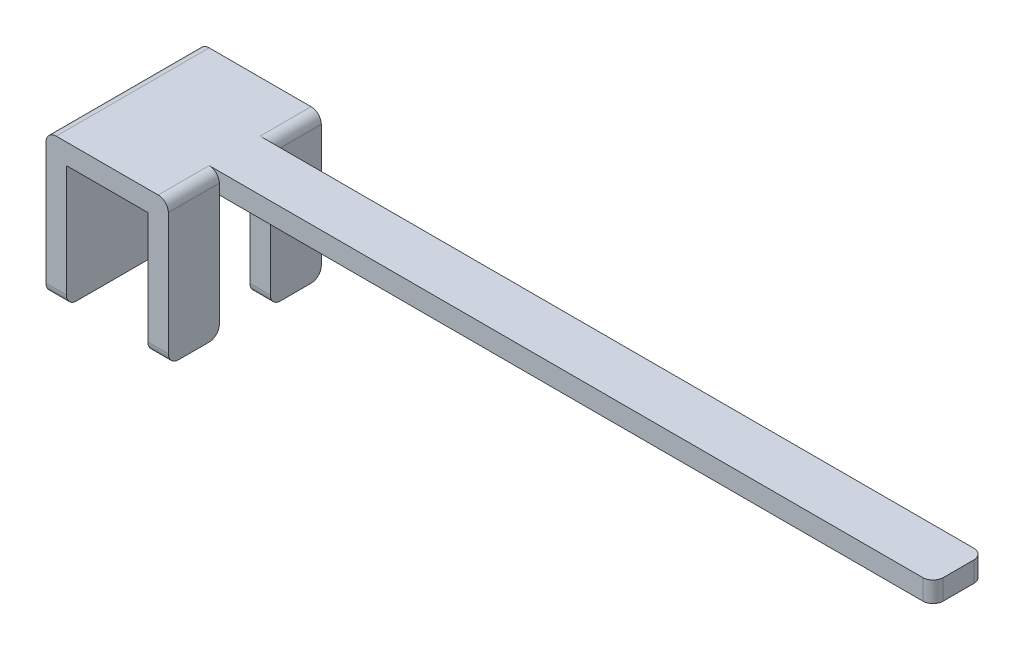
ISO-10303-21;
HEADER;
FILE_DESCRIPTION(('STEP AP214'),'2;1');
FILE_NAME('part.step','',(''),(''),'','','');
FILE_SCHEMA(('AUTOMOTIVE_DESIGN { 1 0 10303 214 1 1 1 1 }'));
ENDSEC;
DATA;
#1=APPLICATION_CONTEXT('core data for automotive mechanical design processes');
#2=APPLICATION_PROTOCOL_DEFINITION('international standard','automotive_design',2000,#1);
#3=PRODUCT_CONTEXT('',#1,'mechanical');
#4=PRODUCT('Part','Part','',(#3));
#5=PRODUCT_RELATED_PRODUCT_CATEGORY('part','',(#4));
#6=PRODUCT_DEFINITION_FORMATION('','',#4);
#7=PRODUCT_DEFINITION_CONTEXT('part definition',#1,'design');
#8=PRODUCT_DEFINITION('design','',#6,#7);
#9=PRODUCT_DEFINITION_SHAPE('','',#8);
#10=(LENGTH_UNIT() NAMED_UNIT(*) SI_UNIT(.MILLI.,.METRE.));
#11=(NAMED_UNIT(*) PLANE_ANGLE_UNIT() SI_UNIT($,.RADIAN.));
#12=(NAMED_UNIT(*) SI_UNIT($,.STERADIAN.) SOLID_ANGLE_UNIT());
#13=UNCERTAINTY_MEASURE_WITH_UNIT(LENGTH_MEASURE(1.E-05),#10,'distance_accuracy_value','');
#14=(GEOMETRIC_REPRESENTATION_CONTEXT(3) GLOBAL_UNCERTAINTY_ASSIGNED_CONTEXT((#13)) GLOBAL_UNIT_ASSIGNED_CONTEXT((#10,
#11,#12)) REPRESENTATION_CONTEXT('',''));
#15=CARTESIAN_POINT('',(0.,0.,0.));
#16=DIRECTION('',(0.,0.,1.));
#17=DIRECTION('',(1.,0.,0.));
#18=AXIS2_PLACEMENT_3D('',#15,#16,#17);
#19=CARTESIAN_POINT('',(0.4,0.6,1.5));
#20=DIRECTION('',(1.,0.,0.));
#21=DIRECTION('',(0.,1.,0.));
#22=AXIS2_PLACEMENT_3D('',#19,#20,#21);
#23=PLANE('',#22);
#24=DIRECTION('',(0.,-1.,0.));
#25=VECTOR('',#24,1.);
#26=CARTESIAN_POINT('',(0.4,0.6,1.));
#27=LINE('',#26,#25);
#28=CARTESIAN_POINT('',(0.4,0.6,1.));
#29=VERTEX_POINT('',#28);
#30=CARTESIAN_POINT('',(0.4,-0.5,1.));
#31=VERTEX_POINT('',#30);
#32=EDGE_CURVE('E213',#29,#31,#27,.T.);
#33=ORIENTED_EDGE('',*,*,#32,.T.);
#34=CARTESIAN_POINT('',(0.4,-0.5,1.1));
#35=DIRECTION('',(1.,0.,0.));
#36=DIRECTION('',(0.,1.,0.));
#37=AXIS2_PLACEMENT_3D('',#34,#35,#36);
#38=CIRCLE('',#37,0.1);
#39=CARTESIAN_POINT('',(0.4,-0.6,1.1));
#40=VERTEX_POINT('',#39);
#41=EDGE_CURVE('E397',#31,#40,#38,.F.);
#42=ORIENTED_EDGE('',*,*,#41,.T.);
#43=DIRECTION('',(0.,0.,-1.));
#44=VECTOR('',#43,1.);
#45=CARTESIAN_POINT('',(0.4,-0.6,1.5));
#46=LINE('',#45,#44);
#47=CARTESIAN_POINT('',(0.4,-0.6,1.4));
#48=VERTEX_POINT('',#47);
#49=EDGE_CURVE('E335',#48,#40,#46,.T.);
#50=ORIENTED_EDGE('',*,*,#49,.F.);
#51=CARTESIAN_POINT('',(0.4,-0.5,1.4));
#52=DIRECTION('',(1.,0.,0.));
#53=DIRECTION('',(0.,1.,0.));
#54=AXIS2_PLACEMENT_3D('',#51,#52,#53);
#55=CIRCLE('',#54,0.1);
#56=CARTESIAN_POINT('',(0.4,-0.5,1.5));
#57=VERTEX_POINT('',#56);
#58=EDGE_CURVE('E50',#48,#57,#55,.F.);
#59=ORIENTED_EDGE('',*,*,#58,.T.);
#60=DIRECTION('',(0.,-1.,0.));
#61=VECTOR('',#60,1.);
#62=CARTESIAN_POINT('',(0.4,0.6,1.5));
#63=LINE('',#62,#61);
#64=CARTESIAN_POINT('',(0.4,0.6,1.5));
#65=VERTEX_POINT('',#64);
#66=EDGE_CURVE('E270',#65,#57,#63,.T.);
#67=ORIENTED_EDGE('',*,*,#66,.F.);
#68=DIRECTION('',(0.,0.,-1.));
#69=VECTOR('',#68,1.);
#70=CARTESIAN_POINT('',(0.4,0.6,1.5));
#71=LINE('',#70,#69);
#72=EDGE_CURVE('E307',#65,#29,#71,.T.);
#73=ORIENTED_EDGE('',*,*,#72,.T.);
#74=EDGE_LOOP('',(#33,#42,#50,#59,#67,#73));
#75=FACE_BOUND('',#74,.T.);
#76=ADVANCED_FACE('F35',(#75),#23,.F.);
#77=CARTESIAN_POINT('',(0.4,-0.6,1.5));
#78=DIRECTION('',(0.,1.,0.));
#79=DIRECTION('',(-1.,0.,0.));
#80=AXIS2_PLACEMENT_3D('',#77,#78,#79);
#81=PLANE('',#80);
#82=ORIENTED_EDGE('',*,*,#49,.T.);
#83=DIRECTION('',(1.,0.,0.));
#84=VECTOR('',#83,1.);
#85=CARTESIAN_POINT('',(0.4,-0.6,1.1));
#86=LINE('',#85,#84);
#87=CARTESIAN_POINT('',(0.6,-0.6,1.1));
#88=VERTEX_POINT('',#87);
#89=EDGE_CURVE('E389',#40,#88,#86,.T.);
#90=ORIENTED_EDGE('',*,*,#89,.T.);
#91=DIRECTION('',(0.,0.,-1.));
#92=VECTOR('',#91,1.);
#93=CARTESIAN_POINT('',(0.6,-0.6,1.5));
#94=LINE('',#93,#92);
#95=CARTESIAN_POINT('',(0.6,-0.6,1.4));
#96=VERTEX_POINT('',#95);
#97=EDGE_CURVE('E332',#96,#88,#94,.T.);
#98=ORIENTED_EDGE('',*,*,#97,.F.);
#99=DIRECTION('',(1.,0.,0.));
#100=VECTOR('',#99,1.);
#101=CARTESIAN_POINT('',(0.4,-0.6,1.4));
#102=LINE('',#101,#100);
#103=EDGE_CURVE('E387',#96,#48,#102,.F.);
#104=ORIENTED_EDGE('',*,*,#103,.T.);
#105=EDGE_LOOP('',(#82,#90,#98,#104));
#106=FACE_BOUND('',#105,.T.);
#107=ADVANCED_FACE('F420',(#106),#81,.F.);
#108=CARTESIAN_POINT('',(0.6,0.699999999999999,1.5));
#109=DIRECTION('',(-1.,0.,0.));
#110=DIRECTION('',(0.,0.,1.));
#111=AXIS2_PLACEMENT_3D('',#108,#109,#110);
#112=PLANE('',#111);
#113=ORIENTED_EDGE('',*,*,#97,.T.);
#114=CARTESIAN_POINT('',(0.6,-0.499999999999999,1.1));
#115=DIRECTION('',(-1.,0.,0.));
#116=DIRECTION('',(0.,0.,1.));
#117=AXIS2_PLACEMENT_3D('',#114,#115,#116);
#118=CIRCLE('',#117,0.1);
#119=CARTESIAN_POINT('',(0.6,-0.499999999999999,1.));
#120=VERTEX_POINT('',#119);
#121=EDGE_CURVE('E228',#88,#120,#118,.F.);
#122=ORIENTED_EDGE('',*,*,#121,.T.);
#123=DIRECTION('',(0.,-1.,0.));
#124=VECTOR('',#123,1.);
#125=CARTESIAN_POINT('',(0.6,0.6,1.));
#126=LINE('',#125,#124);
#127=CARTESIAN_POINT('',(0.6,0.6,1.));
#128=VERTEX_POINT('',#127);
#129=EDGE_CURVE('E212',#128,#120,#126,.T.);
#130=ORIENTED_EDGE('',*,*,#129,.F.);
#131=DIRECTION('',(0.,1.,0.));
#132=VECTOR('',#131,1.);
#133=CARTESIAN_POINT('',(0.6,0.699999999999999,1.));
#134=LINE('',#133,#132);
#135=CARTESIAN_POINT('',(0.6,0.699999999999999,1.));
#136=VERTEX_POINT('',#135);
#137=EDGE_CURVE('E226',#128,#136,#134,.T.);
#138=ORIENTED_EDGE('',*,*,#137,.T.);
#139=DIRECTION('',(0.,0.,-1.));
#140=VECTOR('',#139,1.);
#141=CARTESIAN_POINT('',(0.6,0.699999999999999,1.5));
#142=LINE('',#141,#140);
#143=CARTESIAN_POINT('',(0.6,0.699999999999999,1.5));
#144=VERTEX_POINT('',#143);
#145=EDGE_CURVE('E329',#144,#136,#142,.T.);
#146=ORIENTED_EDGE('',*,*,#145,.F.);
#147=DIRECTION('',(0.,1.,0.));
#148=VECTOR('',#147,1.);
#149=CARTESIAN_POINT('',(0.6,0.699999999999999,1.5));
#150=LINE('',#149,#148);
#151=CARTESIAN_POINT('',(0.6,-0.499999999999999,1.5));
#152=VERTEX_POINT('',#151);
#153=EDGE_CURVE('E272',#152,#144,#150,.T.);
#154=ORIENTED_EDGE('',*,*,#153,.F.);
#155=CARTESIAN_POINT('',(0.6,-0.499999999999999,1.4));
#156=DIRECTION('',(-1.,0.,0.));
#157=DIRECTION('',(0.,0.,1.));
#158=AXIS2_PLACEMENT_3D('',#155,#156,#157);
#159=CIRCLE('',#158,0.1);
#160=EDGE_CURVE('E392',#152,#96,#159,.F.);
#161=ORIENTED_EDGE('',*,*,#160,.T.);
#162=EDGE_LOOP('',(#113,#122,#130,#138,#146,#154,#161));
#163=FACE_BOUND('',#162,.T.);
#164=ADVANCED_FACE('F224',(#163),#112,.F.);
#165=CARTESIAN_POINT('',(0.5,0.699999999999999,1.5));
#166=DIRECTION('',(0.,0.,-1.));
#167=DIRECTION('',(-1.,0.,0.));
#168=AXIS2_PLACEMENT_3D('',#165,#166,#167);
#169=CYLINDRICAL_SURFACE('',#168,0.1);
#170=CARTESIAN_POINT('',(0.5,0.699999999999999,0.5));
#171=DIRECTION('',(0.,0.,1.));
#172=DIRECTION('',(1.,0.,0.));
#173=AXIS2_PLACEMENT_3D('',#170,#171,#172);
#174=CIRCLE('',#173,0.1);
#175=CARTESIAN_POINT('',(0.6,0.699999999999999,0.5));
#176=VERTEX_POINT('',#175);
#177=CARTESIAN_POINT('',(0.5,0.8,0.5));
#178=VERTEX_POINT('',#177);
#179=EDGE_CURVE('E263',#176,#178,#174,.T.);
#180=ORIENTED_EDGE('',*,*,#179,.F.);
#181=CARTESIAN_POINT('',(0.6,0.699999999999999,0.));
#182=VERTEX_POINT('',#181);
#183=EDGE_CURVE('E328',#176,#182,#142,.T.);
#184=ORIENTED_EDGE('',*,*,#183,.T.);
#185=CARTESIAN_POINT('',(0.5,0.699999999999999,0.));
#186=DIRECTION('',(0.,0.,1.));
#187=DIRECTION('',(1.,0.,0.));
#188=AXIS2_PLACEMENT_3D('',#185,#186,#187);
#189=CIRCLE('',#188,0.1);
#190=CARTESIAN_POINT('',(0.5,0.8,0.));
#191=VERTEX_POINT('',#190);
#192=EDGE_CURVE('E293',#182,#191,#189,.T.);
#193=ORIENTED_EDGE('',*,*,#192,.T.);
#194=DIRECTION('',(0.,0.,-1.));
#195=VECTOR('',#194,1.);
#196=CARTESIAN_POINT('',(0.5,0.8,1.5));
#197=LINE('',#196,#195);
#198=EDGE_CURVE('E324',#178,#191,#197,.T.);
#199=ORIENTED_EDGE('',*,*,#198,.F.);
#200=EDGE_LOOP('',(#180,#184,#193,#199));
#201=FACE_BOUND('',#200,.T.);
#202=ADVANCED_FACE('F492',(#201),#169,.T.);
#203=DIRECTION('',(0.,-1.,0.));
#204=VECTOR('',#203,1.);
#205=CARTESIAN_POINT('',(0.4,0.6,0.));
#206=LINE('',#205,#204);
#207=CARTESIAN_POINT('',(0.4,0.6,0.));
#208=VERTEX_POINT('',#207);
#209=CARTESIAN_POINT('',(0.4,-0.5,0.));
#210=VERTEX_POINT('',#209);
#211=EDGE_CURVE('E240',#208,#210,#206,.T.);
#212=ORIENTED_EDGE('',*,*,#211,.T.);
#213=CARTESIAN_POINT('',(0.4,-0.5,0.1));
#214=DIRECTION('',(1.,0.,0.));
#215=DIRECTION('',(0.,1.,0.));
#216=AXIS2_PLACEMENT_3D('',#213,#214,#215);
#217=CIRCLE('',#216,0.1);
#218=CARTESIAN_POINT('',(0.4,-0.6,0.1));
#219=VERTEX_POINT('',#218);
#220=EDGE_CURVE('E382',#210,#219,#217,.F.);
#221=ORIENTED_EDGE('',*,*,#220,.T.);
#222=CARTESIAN_POINT('',(0.4,-0.6,0.4));
#223=VERTEX_POINT('',#222);
#224=EDGE_CURVE('E334',#223,#219,#46,.T.);
#225=ORIENTED_EDGE('',*,*,#224,.F.);
#226=CARTESIAN_POINT('',(0.4,-0.5,0.4));
#227=DIRECTION('',(1.,0.,0.));
#228=DIRECTION('',(0.,1.,0.));
#229=AXIS2_PLACEMENT_3D('',#226,#227,#228);
#230=CIRCLE('',#229,0.1);
#231=CARTESIAN_POINT('',(0.4,-0.5,0.5));
#232=VERTEX_POINT('',#231);
#233=EDGE_CURVE('E380',#223,#232,#230,.F.);
#234=ORIENTED_EDGE('',*,*,#233,.T.);
#235=DIRECTION('',(0.,1.,0.));
#236=VECTOR('',#235,1.);
#237=CARTESIAN_POINT('',(0.4,0.6,0.5));
#238=LINE('',#237,#236);
#239=CARTESIAN_POINT('',(0.4,0.6,0.5));
#240=VERTEX_POINT('',#239);
#241=EDGE_CURVE('E218',#232,#240,#238,.T.);
#242=ORIENTED_EDGE('',*,*,#241,.T.);
#243=EDGE_CURVE('E288',#240,#208,#71,.T.);
#244=ORIENTED_EDGE('',*,*,#243,.T.);
#245=EDGE_LOOP('',(#212,#221,#225,#234,#242,#244));
#246=FACE_BOUND('',#245,.T.);
#247=ADVANCED_FACE('F494',(#246),#23,.F.);
#248=ORIENTED_EDGE('',*,*,#224,.T.);
#249=DIRECTION('',(1.,0.,0.));
#250=VECTOR('',#249,1.);
#251=CARTESIAN_POINT('',(0.4,-0.6,0.1));
#252=LINE('',#251,#250);
#253=CARTESIAN_POINT('',(0.6,-0.6,0.1));
#254=VERTEX_POINT('',#253);
#255=EDGE_CURVE('E373',#219,#254,#252,.T.);
#256=ORIENTED_EDGE('',*,*,#255,.T.);
#257=CARTESIAN_POINT('',(0.6,-0.6,0.4));
#258=VERTEX_POINT('',#257);
#259=EDGE_CURVE('E331',#258,#254,#94,.T.);
#260=ORIENTED_EDGE('',*,*,#259,.F.);
#261=DIRECTION('',(1.,0.,0.));
#262=VECTOR('',#261,1.);
#263=CARTESIAN_POINT('',(0.4,-0.6,0.4));
#264=LINE('',#263,#262);
#265=EDGE_CURVE('E371',#258,#223,#264,.F.);
#266=ORIENTED_EDGE('',*,*,#265,.T.);
#267=EDGE_LOOP('',(#248,#256,#260,#266));
#268=FACE_BOUND('',#267,.T.);
#269=ADVANCED_FACE('F500',(#268),#81,.F.);
#270=ORIENTED_EDGE('',*,*,#259,.T.);
#271=CARTESIAN_POINT('',(0.6,-0.499999999999999,0.1));
#272=DIRECTION('',(-1.,0.,0.));
#273=DIRECTION('',(0.,0.,1.));
#274=AXIS2_PLACEMENT_3D('',#271,#272,#273);
#275=CIRCLE('',#274,0.1);
#276=CARTESIAN_POINT('',(0.6,-0.499999999999999,0.));
#277=VERTEX_POINT('',#276);
#278=EDGE_CURVE('E378',#254,#277,#275,.F.);
#279=ORIENTED_EDGE('',*,*,#278,.T.);
#280=DIRECTION('',(0.,1.,0.));
#281=VECTOR('',#280,1.);
#282=CARTESIAN_POINT('',(0.6,0.699999999999999,0.));
#283=LINE('',#282,#281);
#284=EDGE_CURVE('E291',#277,#182,#283,.T.);
#285=ORIENTED_EDGE('',*,*,#284,.T.);
#286=ORIENTED_EDGE('',*,*,#183,.F.);
#287=DIRECTION('',(0.,1.,0.));
#288=VECTOR('',#287,1.);
#289=CARTESIAN_POINT('',(0.6,0.699999999999999,0.5));
#290=LINE('',#289,#288);
#291=CARTESIAN_POINT('',(0.6,0.6,0.5));
#292=VERTEX_POINT('',#291);
#293=EDGE_CURVE('E266',#292,#176,#290,.T.);
#294=ORIENTED_EDGE('',*,*,#293,.F.);
#295=DIRECTION('',(0.,1.,0.));
#296=VECTOR('',#295,1.);
#297=CARTESIAN_POINT('',(0.6,0.6,0.5));
#298=LINE('',#297,#296);
#299=CARTESIAN_POINT('',(0.6,-0.499999999999999,0.5));
#300=VERTEX_POINT('',#299);
#301=EDGE_CURVE('E229',#300,#292,#298,.T.);
#302=ORIENTED_EDGE('',*,*,#301,.F.);
#303=CARTESIAN_POINT('',(0.6,-0.499999999999999,0.4));
#304=DIRECTION('',(-1.,0.,0.));
#305=DIRECTION('',(0.,0.,1.));
#306=AXIS2_PLACEMENT_3D('',#303,#304,#305);
#307=CIRCLE('',#306,0.1);
#308=EDGE_CURVE('E376',#300,#258,#307,.F.);
#309=ORIENTED_EDGE('',*,*,#308,.T.);
#310=EDGE_LOOP('',(#270,#279,#285,#286,#294,#302,#309));
#311=FACE_BOUND('',#310,.T.);
#312=ADVANCED_FACE('F442',(#311),#112,.F.);
#313=ORIENTED_EDGE('',*,*,#145,.T.);
#314=CARTESIAN_POINT('',(0.5,0.699999999999999,1.));
#315=DIRECTION('',(0.,0.,1.));
#316=DIRECTION('',(1.,0.,0.));
#317=AXIS2_PLACEMENT_3D('',#314,#315,#316);
#318=CIRCLE('',#317,0.1);
#319=CARTESIAN_POINT('',(0.5,0.8,1.));
#320=VERTEX_POINT('',#319);
#321=EDGE_CURVE('E239',#136,#320,#318,.T.);
#322=ORIENTED_EDGE('',*,*,#321,.T.);
#323=CARTESIAN_POINT('',(0.5,0.8,1.5));
#324=VERTEX_POINT('',#323);
#325=EDGE_CURVE('E325',#324,#320,#197,.T.);
#326=ORIENTED_EDGE('',*,*,#325,.F.);
#327=CARTESIAN_POINT('',(0.5,0.699999999999999,1.5));
#328=DIRECTION('',(0.,0.,1.));
#329=DIRECTION('',(1.,0.,0.));
#330=AXIS2_PLACEMENT_3D('',#327,#328,#329);
#331=CIRCLE('',#330,0.1);
#332=EDGE_CURVE('E275',#144,#324,#331,.T.);
#333=ORIENTED_EDGE('',*,*,#332,.F.);
#334=EDGE_LOOP('',(#313,#322,#326,#333));
#335=FACE_BOUND('',#334,.T.);
#336=ADVANCED_FACE('F465',(#335),#169,.T.);
#337=CARTESIAN_POINT('',(-0.5,0.8,1.5));
#338=DIRECTION('',(0.,-1.,0.));
#339=DIRECTION('',(1.,0.,0.));
#340=AXIS2_PLACEMENT_3D('',#337,#338,#339);
#341=PLANE('',#340);
#342=DIRECTION('',(-1.,0.,0.));
#343=VECTOR('',#342,1.);
#344=CARTESIAN_POINT('',(0.,0.8,1.));
#345=LINE('',#344,#343);
#346=CARTESIAN_POINT('',(7.5,0.8,1.));
#347=VERTEX_POINT('',#346);
#348=EDGE_CURVE('E246',#347,#320,#345,.T.);
#349=ORIENTED_EDGE('',*,*,#348,.F.);
#350=CARTESIAN_POINT('',(7.5,0.800000000000002,0.9));
#351=DIRECTION('',(0.,-1.,0.));
#352=DIRECTION('',(1.,0.,0.));
#353=AXIS2_PLACEMENT_3D('',#350,#351,#352);
#354=CIRCLE('',#353,0.1);
#355=CARTESIAN_POINT('',(7.6,0.8,0.9));
#356=VERTEX_POINT('',#355);
#357=EDGE_CURVE('E342',#347,#356,#354,.F.);
#358=ORIENTED_EDGE('',*,*,#357,.T.);
#359=DIRECTION('',(0.,0.,-1.));
#360=VECTOR('',#359,1.);
#361=CARTESIAN_POINT('',(7.6,0.8,1.));
#362=LINE('',#361,#360);
#363=CARTESIAN_POINT('',(7.6,0.8,0.6));
#364=VERTEX_POINT('',#363);
#365=EDGE_CURVE('E249',#356,#364,#362,.T.);
#366=ORIENTED_EDGE('',*,*,#365,.T.);
#367=CARTESIAN_POINT('',(7.5,0.800000000000002,0.6));
#368=DIRECTION('',(0.,-1.,0.));
#369=DIRECTION('',(1.,0.,0.));
#370=AXIS2_PLACEMENT_3D('',#367,#368,#369);
#371=CIRCLE('',#370,0.1);
#372=CARTESIAN_POINT('',(7.5,0.8,0.5));
#373=VERTEX_POINT('',#372);
#374=EDGE_CURVE('E340',#364,#373,#371,.F.);
#375=ORIENTED_EDGE('',*,*,#374,.T.);
#376=DIRECTION('',(-1.,0.,0.));
#377=VECTOR('',#376,1.);
#378=CARTESIAN_POINT('',(0.,0.8,0.5));
#379=LINE('',#378,#377);
#380=EDGE_CURVE('E247',#373,#178,#379,.T.);
#381=ORIENTED_EDGE('',*,*,#380,.T.);
#382=ORIENTED_EDGE('',*,*,#198,.T.);
#383=DIRECTION('',(-1.,0.,0.));
#384=VECTOR('',#383,1.);
#385=CARTESIAN_POINT('',(-0.5,0.8,0.));
#386=LINE('',#385,#384);
#387=CARTESIAN_POINT('',(-0.5,0.8,0.));
#388=VERTEX_POINT('',#387);
#389=EDGE_CURVE('E296',#191,#388,#386,.T.);
#390=ORIENTED_EDGE('',*,*,#389,.T.);
#391=DIRECTION('',(0.,0.,-1.));
#392=VECTOR('',#391,1.);
#393=CARTESIAN_POINT('',(-0.5,0.8,1.5));
#394=LINE('',#393,#392);
#395=CARTESIAN_POINT('',(-0.5,0.8,1.5));
#396=VERTEX_POINT('',#395);
#397=EDGE_CURVE('E321',#396,#388,#394,.T.);
#398=ORIENTED_EDGE('',*,*,#397,.F.);
#399=DIRECTION('',(-1.,0.,0.));
#400=VECTOR('',#399,1.);
#401=CARTESIAN_POINT('',(-0.5,0.8,1.5));
#402=LINE('',#401,#400);
#403=EDGE_CURVE('E277',#324,#396,#402,.T.);
#404=ORIENTED_EDGE('',*,*,#403,.F.);
#405=ORIENTED_EDGE('',*,*,#325,.T.);
#406=EDGE_LOOP('',(#349,#358,#366,#375,#381,#382,#390,#398,#404,#405));
#407=FACE_BOUND('',#406,.T.);
#408=ADVANCED_FACE('F459',(#407),#341,.F.);
#409=CARTESIAN_POINT('',(-0.5,0.7,1.5));
#410=DIRECTION('',(0.,0.,-1.));
#411=DIRECTION('',(-1.,0.,0.));
#412=AXIS2_PLACEMENT_3D('',#409,#410,#411);
#413=CYLINDRICAL_SURFACE('',#412,0.1);
#414=CARTESIAN_POINT('',(-0.5,0.7,0.));
#415=DIRECTION('',(0.,0.,1.));
#416=DIRECTION('',(-1.,0.,0.));
#417=AXIS2_PLACEMENT_3D('',#414,#415,#416);
#418=CIRCLE('',#417,0.1);
#419=CARTESIAN_POINT('',(-0.6,0.7,0.));
#420=VERTEX_POINT('',#419);
#421=EDGE_CURVE('E298',#388,#420,#418,.T.);
#422=ORIENTED_EDGE('',*,*,#421,.T.);
#423=DIRECTION('',(0.,0.,-1.));
#424=VECTOR('',#423,1.);
#425=CARTESIAN_POINT('',(-0.6,0.7,1.5));
#426=LINE('',#425,#424);
#427=CARTESIAN_POINT('',(-0.6,0.7,1.5));
#428=VERTEX_POINT('',#427);
#429=EDGE_CURVE('E318',#428,#420,#426,.T.);
#430=ORIENTED_EDGE('',*,*,#429,.F.);
#431=CARTESIAN_POINT('',(-0.5,0.7,1.5));
#432=DIRECTION('',(0.,0.,1.));
#433=DIRECTION('',(-1.,0.,0.));
#434=AXIS2_PLACEMENT_3D('',#431,#432,#433);
#435=CIRCLE('',#434,0.1);
#436=EDGE_CURVE('E279',#396,#428,#435,.T.);
#437=ORIENTED_EDGE('',*,*,#436,.F.);
#438=ORIENTED_EDGE('',*,*,#397,.T.);
#439=EDGE_LOOP('',(#422,#430,#437,#438));
#440=FACE_BOUND('',#439,.T.);
#441=ADVANCED_FACE('F471',(#440),#413,.T.);
#442=CARTESIAN_POINT('',(-0.6,0.7,1.5));
#443=DIRECTION('',(1.,0.,0.));
#444=DIRECTION('',(0.,0.,-1.));
#445=AXIS2_PLACEMENT_3D('',#442,#443,#444);
#446=PLANE('',#445);
#447=DIRECTION('',(0.,-1.,0.));
#448=VECTOR('',#447,1.);
#449=CARTESIAN_POINT('',(-0.6,0.7,0.));
#450=LINE('',#449,#448);
#451=CARTESIAN_POINT('',(-0.6,-0.5,0.));
#452=VERTEX_POINT('',#451);
#453=EDGE_CURVE('E300',#420,#452,#450,.T.);
#454=ORIENTED_EDGE('',*,*,#453,.T.);
#455=CARTESIAN_POINT('',(-0.6,-0.5,0.1));
#456=DIRECTION('',(1.,0.,0.));
#457=DIRECTION('',(0.,0.,-1.));
#458=AXIS2_PLACEMENT_3D('',#455,#456,#457);
#459=CIRCLE('',#458,0.1);
#460=CARTESIAN_POINT('',(-0.6,-0.6,0.1));
#461=VERTEX_POINT('',#460);
#462=EDGE_CURVE('E369',#452,#461,#459,.F.);
#463=ORIENTED_EDGE('',*,*,#462,.T.);
#464=DIRECTION('',(0.,0.,-1.));
#465=VECTOR('',#464,1.);
#466=CARTESIAN_POINT('',(-0.6,-0.6,1.5));
#467=LINE('',#466,#465);
#468=CARTESIAN_POINT('',(-0.6,-0.6,1.4));
#469=VERTEX_POINT('',#468);
#470=EDGE_CURVE('E315',#469,#461,#467,.T.);
#471=ORIENTED_EDGE('',*,*,#470,.F.);
#472=CARTESIAN_POINT('',(-0.6,-0.5,1.4));
#473=DIRECTION('',(1.,0.,0.));
#474=DIRECTION('',(0.,0.,-1.));
#475=AXIS2_PLACEMENT_3D('',#472,#473,#474);
#476=CIRCLE('',#475,0.1);
#477=CARTESIAN_POINT('',(-0.6,-0.5,1.5));
#478=VERTEX_POINT('',#477);
#479=EDGE_CURVE('E367',#469,#478,#476,.F.);
#480=ORIENTED_EDGE('',*,*,#479,.T.);
#481=DIRECTION('',(0.,-1.,0.));
#482=VECTOR('',#481,1.);
#483=CARTESIAN_POINT('',(-0.6,0.7,1.5));
#484=LINE('',#483,#482);
#485=EDGE_CURVE('E281',#428,#478,#484,.T.);
#486=ORIENTED_EDGE('',*,*,#485,.F.);
#487=ORIENTED_EDGE('',*,*,#429,.T.);
#488=EDGE_LOOP('',(#454,#463,#471,#480,#486,#487));
#489=FACE_BOUND('',#488,.T.);
#490=ADVANCED_FACE('F474',(#489),#446,.F.);
#491=CARTESIAN_POINT('',(-0.4,-0.6,1.5));
#492=DIRECTION('',(0.,1.,0.));
#493=DIRECTION('',(0.,0.,1.));
#494=AXIS2_PLACEMENT_3D('',#491,#492,#493);
#495=PLANE('',#494);
#496=ORIENTED_EDGE('',*,*,#470,.T.);
#497=DIRECTION('',(1.,0.,0.));
#498=VECTOR('',#497,1.);
#499=CARTESIAN_POINT('',(-0.4,-0.6,0.1));
#500=LINE('',#499,#498);
#501=CARTESIAN_POINT('',(-0.4,-0.6,0.1));
#502=VERTEX_POINT('',#501);
#503=EDGE_CURVE('E356',#461,#502,#500,.T.);
#504=ORIENTED_EDGE('',*,*,#503,.T.);
#505=DIRECTION('',(0.,0.,-1.));
#506=VECTOR('',#505,1.);
#507=CARTESIAN_POINT('',(-0.4,-0.6,1.5));
#508=LINE('',#507,#506);
#509=CARTESIAN_POINT('',(-0.4,-0.6,1.4));
#510=VERTEX_POINT('',#509);
#511=EDGE_CURVE('E312',#510,#502,#508,.T.);
#512=ORIENTED_EDGE('',*,*,#511,.F.);
#513=DIRECTION('',(1.,0.,0.));
#514=VECTOR('',#513,1.);
#515=CARTESIAN_POINT('',(-0.6,-0.6,1.4));
#516=LINE('',#515,#514);
#517=EDGE_CURVE('E354',#510,#469,#516,.F.);
#518=ORIENTED_EDGE('',*,*,#517,.T.);
#519=EDGE_LOOP('',(#496,#504,#512,#518));
#520=FACE_BOUND('',#519,.T.);
#521=ADVANCED_FACE('F478',(#520),#495,.F.);
#522=CARTESIAN_POINT('',(-0.4,0.6,1.5));
#523=DIRECTION('',(-1.,0.,0.));
#524=DIRECTION('',(0.,-1.,0.));
#525=AXIS2_PLACEMENT_3D('',#522,#523,#524);
#526=PLANE('',#525);
#527=ORIENTED_EDGE('',*,*,#511,.T.);
#528=CARTESIAN_POINT('',(-0.4,-0.5,0.1));
#529=DIRECTION('',(-1.,0.,0.));
#530=DIRECTION('',(0.,-1.,0.));
#531=AXIS2_PLACEMENT_3D('',#528,#529,#530);
#532=CIRCLE('',#531,0.1);
#533=CARTESIAN_POINT('',(-0.4,-0.5,0.));
#534=VERTEX_POINT('',#533);
#535=EDGE_CURVE('E361',#502,#534,#532,.F.);
#536=ORIENTED_EDGE('',*,*,#535,.T.);
#537=DIRECTION('',(0.,1.,0.));
#538=VECTOR('',#537,1.);
#539=CARTESIAN_POINT('',(-0.4,0.6,0.));
#540=LINE('',#539,#538);
#541=CARTESIAN_POINT('',(-0.4,0.6,0.));
#542=VERTEX_POINT('',#541);
#543=EDGE_CURVE('E303',#534,#542,#540,.T.);
#544=ORIENTED_EDGE('',*,*,#543,.T.);
#545=DIRECTION('',(0.,0.,-1.));
#546=VECTOR('',#545,1.);
#547=CARTESIAN_POINT('',(-0.4,0.6,1.5));
#548=LINE('',#547,#546);
#549=CARTESIAN_POINT('',(-0.4,0.6,1.5));
#550=VERTEX_POINT('',#549);
#551=EDGE_CURVE('E309',#550,#542,#548,.T.);
#552=ORIENTED_EDGE('',*,*,#551,.F.);
#553=DIRECTION('',(0.,1.,0.));
#554=VECTOR('',#553,1.);
#555=CARTESIAN_POINT('',(-0.4,0.6,1.5));
#556=LINE('',#555,#554);
#557=CARTESIAN_POINT('',(-0.4,-0.5,1.5));
#558=VERTEX_POINT('',#557);
#559=EDGE_CURVE('E284',#558,#550,#556,.T.);
#560=ORIENTED_EDGE('',*,*,#559,.F.);
#561=CARTESIAN_POINT('',(-0.4,-0.5,1.4));
#562=DIRECTION('',(-1.,0.,0.));
#563=DIRECTION('',(0.,-1.,0.));
#564=AXIS2_PLACEMENT_3D('',#561,#562,#563);
#565=CIRCLE('',#564,0.1);
#566=EDGE_CURVE('E359',#558,#510,#565,.F.);
#567=ORIENTED_EDGE('',*,*,#566,.T.);
#568=EDGE_LOOP('',(#527,#536,#544,#552,#560,#567));
#569=FACE_BOUND('',#568,.T.);
#570=ADVANCED_FACE('F408',(#569),#526,.F.);
#571=CARTESIAN_POINT('',(-0.4,0.6,1.5));
#572=DIRECTION('',(0.,1.,0.));
#573=DIRECTION('',(0.,0.,1.));
#574=AXIS2_PLACEMENT_3D('',#571,#572,#573);
#575=PLANE('',#574);
#576=DIRECTION('',(0.,0.,-1.));
#577=VECTOR('',#576,1.);
#578=CARTESIAN_POINT('',(7.6,0.6,1.));
#579=LINE('',#578,#577);
#580=CARTESIAN_POINT('',(7.6,0.6,0.9));
#581=VERTEX_POINT('',#580);
#582=CARTESIAN_POINT('',(7.6,0.6,0.6));
#583=VERTEX_POINT('',#582);
#584=EDGE_CURVE('E260',#581,#583,#579,.T.);
#585=ORIENTED_EDGE('',*,*,#584,.F.);
#586=CARTESIAN_POINT('',(7.5,0.6,0.9));
#587=DIRECTION('',(0.,1.,0.));
#588=DIRECTION('',(0.,0.,1.));
#589=AXIS2_PLACEMENT_3D('',#586,#587,#588);
#590=CIRCLE('',#589,0.1);
#591=CARTESIAN_POINT('',(7.5,0.6,1.));
#592=VERTEX_POINT('',#591);
#593=EDGE_CURVE('E245',#581,#592,#590,.F.);
#594=ORIENTED_EDGE('',*,*,#593,.T.);
#595=DIRECTION('',(1.,0.,0.));
#596=VECTOR('',#595,1.);
#597=CARTESIAN_POINT('',(0.,0.6,1.));
#598=LINE('',#597,#596);
#599=EDGE_CURVE('E236',#128,#592,#598,.T.);
#600=ORIENTED_EDGE('',*,*,#599,.F.);
#601=DIRECTION('',(1.,0.,0.));
#602=VECTOR('',#601,1.);
#603=CARTESIAN_POINT('',(0.1,0.6,1.));
#604=LINE('',#603,#602);
#605=EDGE_CURVE('E209',#29,#128,#604,.T.);
#606=ORIENTED_EDGE('',*,*,#605,.F.);
#607=ORIENTED_EDGE('',*,*,#72,.F.);
#608=DIRECTION('',(1.,0.,0.));
#609=VECTOR('',#608,1.);
#610=CARTESIAN_POINT('',(-0.4,0.6,1.5));
#611=LINE('',#610,#609);
#612=EDGE_CURVE('E286',#550,#65,#611,.T.);
#613=ORIENTED_EDGE('',*,*,#612,.F.);
#614=ORIENTED_EDGE('',*,*,#551,.T.);
#615=DIRECTION('',(1.,0.,0.));
#616=VECTOR('',#615,1.);
#617=CARTESIAN_POINT('',(-0.4,0.6,0.));
#618=LINE('',#617,#616);
#619=EDGE_CURVE('E273',#542,#208,#618,.T.);
#620=ORIENTED_EDGE('',*,*,#619,.T.);
#621=ORIENTED_EDGE('',*,*,#243,.F.);
#622=DIRECTION('',(1.,0.,0.));
#623=VECTOR('',#622,1.);
#624=CARTESIAN_POINT('',(0.1,0.6,0.5));
#625=LINE('',#624,#623);
#626=EDGE_CURVE('E219',#240,#292,#625,.T.);
#627=ORIENTED_EDGE('',*,*,#626,.T.);
#628=DIRECTION('',(1.,0.,0.));
#629=VECTOR('',#628,1.);
#630=CARTESIAN_POINT('',(0.,0.6,0.5));
#631=LINE('',#630,#629);
#632=CARTESIAN_POINT('',(7.5,0.6,0.5));
#633=VERTEX_POINT('',#632);
#634=EDGE_CURVE('E251',#292,#633,#631,.T.);
#635=ORIENTED_EDGE('',*,*,#634,.T.);
#636=CARTESIAN_POINT('',(7.5,0.6,0.6));
#637=DIRECTION('',(0.,1.,0.));
#638=DIRECTION('',(0.,0.,1.));
#639=AXIS2_PLACEMENT_3D('',#636,#637,#638);
#640=CIRCLE('',#639,0.1);
#641=EDGE_CURVE('E349',#633,#583,#640,.F.);
#642=ORIENTED_EDGE('',*,*,#641,.T.);
#643=EDGE_LOOP('',(#585,#594,#600,#606,#607,#613,#614,#620,#621,#627,#635,#642));
#644=FACE_BOUND('',#643,.T.);
#645=ADVANCED_FACE('F243',(#644),#575,.F.);
#646=CARTESIAN_POINT('',(0.5,0.699999999999999,1.5));
#647=DIRECTION('',(0.,0.,1.));
#648=DIRECTION('',(1.,0.,0.));
#649=AXIS2_PLACEMENT_3D('',#646,#647,#648);
#650=PLANE('',#649);
#651=ORIENTED_EDGE('',*,*,#66,.T.);
#652=DIRECTION('',(1.,0.,0.));
#653=VECTOR('',#652,1.);
#654=CARTESIAN_POINT('',(0.6,-0.499999999999999,1.5));
#655=LINE('',#654,#653);
#656=EDGE_CURVE('E11',#57,#152,#655,.T.);
#657=ORIENTED_EDGE('',*,*,#656,.T.);
#658=ORIENTED_EDGE('',*,*,#153,.T.);
#659=ORIENTED_EDGE('',*,*,#332,.T.);
#660=ORIENTED_EDGE('',*,*,#403,.T.);
#661=ORIENTED_EDGE('',*,*,#436,.T.);
#662=ORIENTED_EDGE('',*,*,#485,.T.);
#663=DIRECTION('',(1.,0.,0.));
#664=VECTOR('',#663,1.);
#665=CARTESIAN_POINT('',(-0.4,-0.5,1.5));
#666=LINE('',#665,#664);
#667=EDGE_CURVE('E43',#478,#558,#666,.T.);
#668=ORIENTED_EDGE('',*,*,#667,.T.);
#669=ORIENTED_EDGE('',*,*,#559,.T.);
#670=ORIENTED_EDGE('',*,*,#612,.T.);
#671=EDGE_LOOP('',(#651,#657,#658,#659,#660,#661,#662,#668,#669,#670));
#672=FACE_BOUND('',#671,.T.);
#673=ADVANCED_FACE('F402',(#672),#650,.T.);
#674=CARTESIAN_POINT('',(0.5,0.699999999999999,0.));
#675=DIRECTION('',(0.,0.,1.));
#676=DIRECTION('',(1.,0.,0.));
#677=AXIS2_PLACEMENT_3D('',#674,#675,#676);
#678=PLANE('',#677);
#679=ORIENTED_EDGE('',*,*,#543,.F.);
#680=DIRECTION('',(1.,0.,0.));
#681=VECTOR('',#680,1.);
#682=CARTESIAN_POINT('',(0.5,-0.5,0.));
#683=LINE('',#682,#681);
#684=EDGE_CURVE('E365',#534,#452,#683,.F.);
#685=ORIENTED_EDGE('',*,*,#684,.T.);
#686=ORIENTED_EDGE('',*,*,#453,.F.);
#687=ORIENTED_EDGE('',*,*,#421,.F.);
#688=ORIENTED_EDGE('',*,*,#389,.F.);
#689=ORIENTED_EDGE('',*,*,#192,.F.);
#690=ORIENTED_EDGE('',*,*,#284,.F.);
#691=DIRECTION('',(1.,0.,0.));
#692=VECTOR('',#691,1.);
#693=CARTESIAN_POINT('',(0.500000000000003,-0.5,0.));
#694=LINE('',#693,#692);
#695=EDGE_CURVE('E363',#277,#210,#694,.F.);
#696=ORIENTED_EDGE('',*,*,#695,.T.);
#697=ORIENTED_EDGE('',*,*,#211,.F.);
#698=ORIENTED_EDGE('',*,*,#619,.F.);
#699=EDGE_LOOP('',(#679,#685,#686,#687,#688,#689,#690,#696,#697,#698));
#700=FACE_BOUND('',#699,.T.);
#701=ADVANCED_FACE('F483',(#700),#678,.F.);
#702=CARTESIAN_POINT('',(0.,0.,1.));
#703=DIRECTION('',(0.,0.,1.));
#704=DIRECTION('',(1.,0.,0.));
#705=AXIS2_PLACEMENT_3D('',#702,#703,#704);
#706=PLANE('',#705);
#707=ORIENTED_EDGE('',*,*,#599,.T.);
#708=DIRECTION('',(0.,1.,0.));
#709=VECTOR('',#708,1.);
#710=CARTESIAN_POINT('',(7.5,0.8,1.));
#711=LINE('',#710,#709);
#712=EDGE_CURVE('E338',#592,#347,#711,.T.);
#713=ORIENTED_EDGE('',*,*,#712,.T.);
#714=ORIENTED_EDGE('',*,*,#348,.T.);
#715=ORIENTED_EDGE('',*,*,#321,.F.);
#716=ORIENTED_EDGE('',*,*,#137,.F.);
#717=EDGE_LOOP('',(#707,#713,#714,#715,#716));
#718=FACE_BOUND('',#717,.T.);
#719=ADVANCED_FACE('F234',(#718),#706,.T.);
#720=CARTESIAN_POINT('',(0.,0.,0.5));
#721=DIRECTION('',(0.,0.,1.));
#722=DIRECTION('',(1.,0.,0.));
#723=AXIS2_PLACEMENT_3D('',#720,#721,#722);
#724=PLANE('',#723);
#725=ORIENTED_EDGE('',*,*,#380,.F.);
#726=DIRECTION('',(0.,1.,0.));
#727=VECTOR('',#726,1.);
#728=CARTESIAN_POINT('',(7.5,0.,0.5));
#729=LINE('',#728,#727);
#730=EDGE_CURVE('E352',#373,#633,#729,.F.);
#731=ORIENTED_EDGE('',*,*,#730,.T.);
#732=ORIENTED_EDGE('',*,*,#634,.F.);
#733=ORIENTED_EDGE('',*,*,#293,.T.);
#734=ORIENTED_EDGE('',*,*,#179,.T.);
#735=EDGE_LOOP('',(#725,#731,#732,#733,#734));
#736=FACE_BOUND('',#735,.T.);
#737=ADVANCED_FACE('F446',(#736),#724,.F.);
#738=CARTESIAN_POINT('',(7.6,0.8,1.));
#739=DIRECTION('',(-1.,0.,0.));
#740=DIRECTION('',(0.,0.,1.));
#741=AXIS2_PLACEMENT_3D('',#738,#739,#740);
#742=PLANE('',#741);
#743=ORIENTED_EDGE('',*,*,#365,.F.);
#744=DIRECTION('',(0.,1.,0.));
#745=VECTOR('',#744,1.);
#746=CARTESIAN_POINT('',(7.6,0.6,0.9));
#747=LINE('',#746,#745);
#748=EDGE_CURVE('E347',#356,#581,#747,.F.);
#749=ORIENTED_EDGE('',*,*,#748,.T.);
#750=ORIENTED_EDGE('',*,*,#584,.T.);
#751=DIRECTION('',(0.,1.,0.));
#752=VECTOR('',#751,1.);
#753=CARTESIAN_POINT('',(7.6,0.8,0.6));
#754=LINE('',#753,#752);
#755=EDGE_CURVE('E344',#583,#364,#754,.T.);
#756=ORIENTED_EDGE('',*,*,#755,.T.);
#757=EDGE_LOOP('',(#743,#749,#750,#756));
#758=FACE_BOUND('',#757,.T.);
#759=ADVANCED_FACE('F453',(#758),#742,.F.);
#760=CARTESIAN_POINT('',(0.1,0.6,1.));
#761=DIRECTION('',(0.,0.,1.));
#762=DIRECTION('',(1.,0.,0.));
#763=AXIS2_PLACEMENT_3D('',#760,#761,#762);
#764=PLANE('',#763);
#765=ORIENTED_EDGE('',*,*,#129,.T.);
#766=DIRECTION('',(1.,0.,0.));
#767=VECTOR('',#766,1.);
#768=CARTESIAN_POINT('',(0.100000000000002,-0.500000000000001,1.));
#769=LINE('',#768,#767);
#770=EDGE_CURVE('E58',#120,#31,#769,.F.);
#771=ORIENTED_EDGE('',*,*,#770,.T.);
#772=ORIENTED_EDGE('',*,*,#32,.F.);
#773=ORIENTED_EDGE('',*,*,#605,.T.);
#774=EDGE_LOOP('',(#765,#771,#772,#773));
#775=FACE_BOUND('',#774,.T.);
#776=ADVANCED_FACE('F211',(#775),#764,.F.);
#777=CARTESIAN_POINT('',(0.1,0.6,0.5));
#778=DIRECTION('',(0.,0.,-1.));
#779=DIRECTION('',(-1.,0.,0.));
#780=AXIS2_PLACEMENT_3D('',#777,#778,#779);
#781=PLANE('',#780);
#782=ORIENTED_EDGE('',*,*,#241,.F.);
#783=DIRECTION('',(1.,0.,0.));
#784=VECTOR('',#783,1.);
#785=CARTESIAN_POINT('',(0.100000000000002,-0.500000000000001,0.5));
#786=LINE('',#785,#784);
#787=EDGE_CURVE('E384',#232,#300,#786,.T.);
#788=ORIENTED_EDGE('',*,*,#787,.T.);
#789=ORIENTED_EDGE('',*,*,#301,.T.);
#790=ORIENTED_EDGE('',*,*,#626,.F.);
#791=EDGE_LOOP('',(#782,#788,#789,#790));
#792=FACE_BOUND('',#791,.T.);
#793=ADVANCED_FACE('F433',(#792),#781,.F.);
#794=CARTESIAN_POINT('',(7.5,0.,0.9));
#795=DIRECTION('',(0.,-1.,0.));
#796=DIRECTION('',(0.,0.,-1.));
#797=AXIS2_PLACEMENT_3D('',#794,#795,#796);
#798=CYLINDRICAL_SURFACE('',#797,0.1);
#799=ORIENTED_EDGE('',*,*,#593,.F.);
#800=ORIENTED_EDGE('',*,*,#748,.F.);
#801=ORIENTED_EDGE('',*,*,#357,.F.);
#802=ORIENTED_EDGE('',*,*,#712,.F.);
#803=EDGE_LOOP('',(#799,#800,#801,#802));
#804=FACE_BOUND('',#803,.T.);
#805=ADVANCED_FACE('F456',(#804),#798,.T.);
#806=CARTESIAN_POINT('',(7.5,0.8,0.6));
#807=DIRECTION('',(0.,1.,0.));
#808=DIRECTION('',(0.,0.,1.));
#809=AXIS2_PLACEMENT_3D('',#806,#807,#808);
#810=CYLINDRICAL_SURFACE('',#809,0.1);
#811=ORIENTED_EDGE('',*,*,#641,.F.);
#812=ORIENTED_EDGE('',*,*,#730,.F.);
#813=ORIENTED_EDGE('',*,*,#374,.F.);
#814=ORIENTED_EDGE('',*,*,#755,.F.);
#815=EDGE_LOOP('',(#811,#812,#813,#814));
#816=FACE_BOUND('',#815,.T.);
#817=ADVANCED_FACE('F449',(#816),#810,.T.);
#818=CARTESIAN_POINT('',(-0.4,-0.5,0.1));
#819=DIRECTION('',(1.,0.,0.));
#820=DIRECTION('',(0.,0.,-1.));
#821=AXIS2_PLACEMENT_3D('',#818,#819,#820);
#822=CYLINDRICAL_SURFACE('',#821,0.1);
#823=ORIENTED_EDGE('',*,*,#462,.F.);
#824=ORIENTED_EDGE('',*,*,#684,.F.);
#825=ORIENTED_EDGE('',*,*,#535,.F.);
#826=ORIENTED_EDGE('',*,*,#503,.F.);
#827=EDGE_LOOP('',(#823,#824,#825,#826));
#828=FACE_BOUND('',#827,.T.);
#829=ADVANCED_FACE('F486',(#828),#822,.T.);
#830=CARTESIAN_POINT('',(0.4,-0.5,0.1));
#831=DIRECTION('',(1.,0.,0.));
#832=DIRECTION('',(0.,1.,0.));
#833=AXIS2_PLACEMENT_3D('',#830,#831,#832);
#834=CYLINDRICAL_SURFACE('',#833,0.1);
#835=ORIENTED_EDGE('',*,*,#220,.F.);
#836=ORIENTED_EDGE('',*,*,#695,.F.);
#837=ORIENTED_EDGE('',*,*,#278,.F.);
#838=ORIENTED_EDGE('',*,*,#255,.F.);
#839=EDGE_LOOP('',(#835,#836,#837,#838));
#840=FACE_BOUND('',#839,.T.);
#841=ADVANCED_FACE('F517',(#840),#834,.T.);
#842=CARTESIAN_POINT('',(0.100000000000002,-0.500000000000001,0.4));
#843=DIRECTION('',(1.,0.,0.));
#844=DIRECTION('',(0.,1.,0.));
#845=AXIS2_PLACEMENT_3D('',#842,#843,#844);
#846=CYLINDRICAL_SURFACE('',#845,0.1);
#847=ORIENTED_EDGE('',*,*,#233,.F.);
#848=ORIENTED_EDGE('',*,*,#265,.F.);
#849=ORIENTED_EDGE('',*,*,#308,.F.);
#850=ORIENTED_EDGE('',*,*,#787,.F.);
#851=EDGE_LOOP('',(#847,#848,#849,#850));
#852=FACE_BOUND('',#851,.T.);
#853=ADVANCED_FACE('F520',(#852),#846,.T.);
#854=CARTESIAN_POINT('',(0.4,-0.5,1.1));
#855=DIRECTION('',(1.,0.,0.));
#856=DIRECTION('',(0.,1.,0.));
#857=AXIS2_PLACEMENT_3D('',#854,#855,#856);
#858=CYLINDRICAL_SURFACE('',#857,0.1);
#859=ORIENTED_EDGE('',*,*,#41,.F.);
#860=ORIENTED_EDGE('',*,*,#770,.F.);
#861=ORIENTED_EDGE('',*,*,#121,.F.);
#862=ORIENTED_EDGE('',*,*,#89,.F.);
#863=EDGE_LOOP('',(#859,#860,#861,#862));
#864=FACE_BOUND('',#863,.T.);
#865=ADVANCED_FACE('F424',(#864),#858,.T.);
#866=CARTESIAN_POINT('',(0.500000000000003,-0.5,1.4));
#867=DIRECTION('',(-1.,0.,0.));
#868=DIRECTION('',(0.,-1.,0.));
#869=AXIS2_PLACEMENT_3D('',#866,#867,#868);
#870=CYLINDRICAL_SURFACE('',#869,0.1);
#871=ORIENTED_EDGE('',*,*,#58,.F.);
#872=ORIENTED_EDGE('',*,*,#103,.F.);
#873=ORIENTED_EDGE('',*,*,#160,.F.);
#874=ORIENTED_EDGE('',*,*,#656,.F.);
#875=EDGE_LOOP('',(#871,#872,#873,#874));
#876=FACE_BOUND('',#875,.T.);
#877=ADVANCED_FACE('F416',(#876),#870,.T.);
#878=CARTESIAN_POINT('',(0.5,-0.5,1.4));
#879=DIRECTION('',(-1.,0.,0.));
#880=DIRECTION('',(0.,0.,1.));
#881=AXIS2_PLACEMENT_3D('',#878,#879,#880);
#882=CYLINDRICAL_SURFACE('',#881,0.1);
#883=ORIENTED_EDGE('',*,*,#479,.F.);
#884=ORIENTED_EDGE('',*,*,#517,.F.);
#885=ORIENTED_EDGE('',*,*,#566,.F.);
#886=ORIENTED_EDGE('',*,*,#667,.F.);
#887=EDGE_LOOP('',(#883,#884,#885,#886));
#888=FACE_BOUND('',#887,.T.);
#889=ADVANCED_FACE('F37',(#888),#882,.T.);
#890=CLOSED_SHELL('',(#76,#107,#164,#202,#247,#269,#312,#336,#408,#441,#490,#521,#570,#645,#673,
#701,#719,#737,#759,#776,#793,#805,#817,#829,#841,#853,#865,#877,#889));
#891=MANIFOLD_SOLID_BREP('B2',#890);
#892=ADVANCED_BREP_SHAPE_REPRESENTATION('',(#18,#891),#14);
#893=SHAPE_DEFINITION_REPRESENTATION(#9,#892);
ENDSEC;
END-ISO-10303-21;
